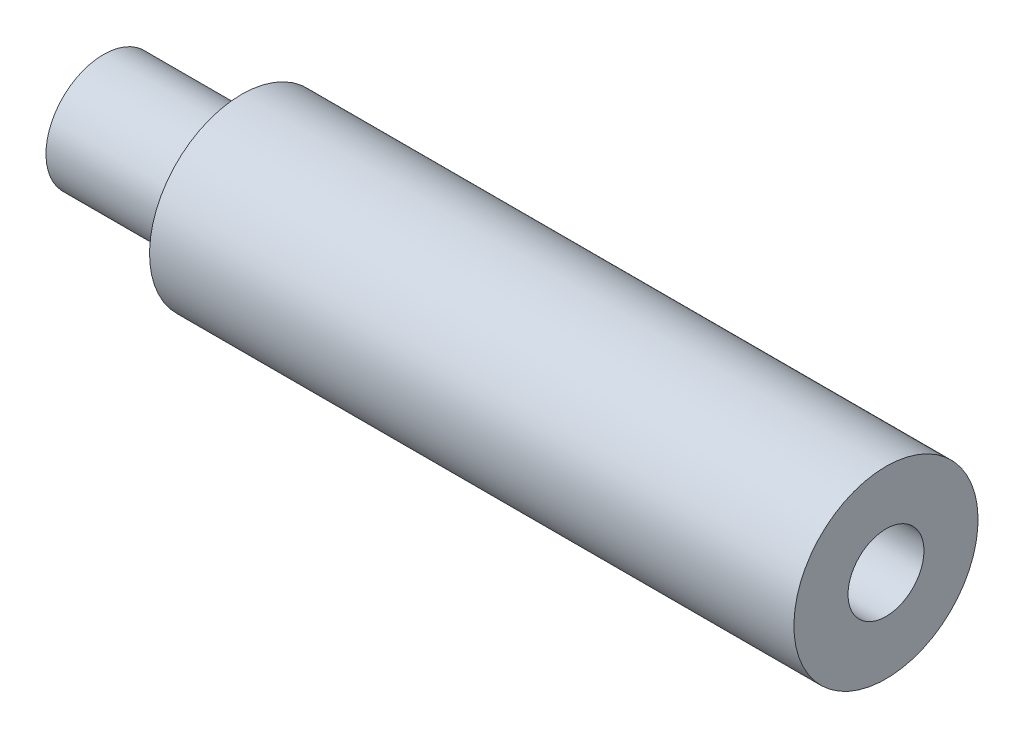
ISO-10303-21;
HEADER;
FILE_DESCRIPTION(('STEP AP214'),'2;1');
FILE_NAME('part.step','',(''),(''),'','','');
FILE_SCHEMA(('AUTOMOTIVE_DESIGN { 1 0 10303 214 1 1 1 1 }'));
ENDSEC;
DATA;
#1=APPLICATION_CONTEXT('core data for automotive mechanical design processes');
#2=APPLICATION_PROTOCOL_DEFINITION('international standard','automotive_design',2000,#1);
#3=PRODUCT_CONTEXT('',#1,'mechanical');
#4=PRODUCT('Part','Part','',(#3));
#5=PRODUCT_RELATED_PRODUCT_CATEGORY('part','',(#4));
#6=PRODUCT_DEFINITION_FORMATION('','',#4);
#7=PRODUCT_DEFINITION_CONTEXT('part definition',#1,'design');
#8=PRODUCT_DEFINITION('design','',#6,#7);
#9=PRODUCT_DEFINITION_SHAPE('','',#8);
#10=(LENGTH_UNIT() NAMED_UNIT(*) SI_UNIT(.MILLI.,.METRE.));
#11=(NAMED_UNIT(*) PLANE_ANGLE_UNIT() SI_UNIT($,.RADIAN.));
#12=(NAMED_UNIT(*) SI_UNIT($,.STERADIAN.) SOLID_ANGLE_UNIT());
#13=UNCERTAINTY_MEASURE_WITH_UNIT(LENGTH_MEASURE(1.E-05),#10,'distance_accuracy_value','');
#14=(GEOMETRIC_REPRESENTATION_CONTEXT(3) GLOBAL_UNCERTAINTY_ASSIGNED_CONTEXT((#13)) GLOBAL_UNIT_ASSIGNED_CONTEXT((#10,
#11,#12)) REPRESENTATION_CONTEXT('',''));
#15=CARTESIAN_POINT('',(0.,0.,0.));
#16=DIRECTION('',(0.,0.,1.));
#17=DIRECTION('',(1.,0.,0.));
#18=AXIS2_PLACEMENT_3D('',#15,#16,#17);
#19=CARTESIAN_POINT('',(0.,0.,0.));
#20=DIRECTION('',(-1.,0.,0.));
#21=DIRECTION('',(0.,-1.,0.));
#22=AXIS2_PLACEMENT_3D('',#19,#20,#21);
#23=PLANE('',#22);
#24=CARTESIAN_POINT('',(0.,0.,0.));
#25=DIRECTION('',(1.,0.,0.));
#26=DIRECTION('',(0.,1.,0.));
#27=AXIS2_PLACEMENT_3D('',#24,#25,#26);
#28=CIRCLE('',#27,2.5);
#29=CARTESIAN_POINT('',(0.,2.5,0.));
#30=VERTEX_POINT('',#29);
#31=EDGE_CURVE('E11',#30,#30,#28,.T.);
#32=ORIENTED_EDGE('',*,*,#31,.F.);
#33=EDGE_LOOP('',(#32));
#34=FACE_BOUND('',#33,.T.);
#35=ADVANCED_FACE('F39',(#34),#23,.T.);
#36=CARTESIAN_POINT('',(34.,0.,0.));
#37=DIRECTION('',(1.,0.,0.));
#38=DIRECTION('',(0.,1.,0.));
#39=AXIS2_PLACEMENT_3D('',#36,#37,#38);
#40=CYLINDRICAL_SURFACE('',#39,2.5);
#41=ORIENTED_EDGE('',*,*,#31,.T.);
#42=EDGE_LOOP('',(#41));
#43=FACE_BOUND('',#42,.T.);
#44=CARTESIAN_POINT('',(6.,0.,0.));
#45=DIRECTION('',(1.,0.,0.));
#46=DIRECTION('',(0.,1.,0.));
#47=AXIS2_PLACEMENT_3D('',#44,#45,#46);
#48=CIRCLE('',#47,2.5);
#49=CARTESIAN_POINT('',(6.,2.5,0.));
#50=VERTEX_POINT('',#49);
#51=EDGE_CURVE('E45',#50,#50,#48,.T.);
#52=ORIENTED_EDGE('',*,*,#51,.F.);
#53=EDGE_LOOP('',(#52));
#54=FACE_BOUND('',#53,.T.);
#55=ADVANCED_FACE('F74',(#43,#54),#40,.T.);
#56=CARTESIAN_POINT('',(6.,2.5,0.));
#57=DIRECTION('',(-1.,0.,0.));
#58=DIRECTION('',(0.,-1.,0.));
#59=AXIS2_PLACEMENT_3D('',#56,#57,#58);
#60=PLANE('',#59);
#61=ORIENTED_EDGE('',*,*,#51,.T.);
#62=EDGE_LOOP('',(#61));
#63=FACE_BOUND('',#62,.T.);
#64=CARTESIAN_POINT('',(6.,0.,0.));
#65=DIRECTION('',(1.,0.,0.));
#66=DIRECTION('',(0.,1.,0.));
#67=AXIS2_PLACEMENT_3D('',#64,#65,#66);
#68=CIRCLE('',#67,4.);
#69=CARTESIAN_POINT('',(6.,4.,0.));
#70=VERTEX_POINT('',#69);
#71=EDGE_CURVE('E66',#70,#70,#68,.T.);
#72=ORIENTED_EDGE('',*,*,#71,.F.);
#73=EDGE_LOOP('',(#72));
#74=FACE_BOUND('',#73,.T.);
#75=ADVANCED_FACE('F71',(#63,#74),#60,.T.);
#76=CARTESIAN_POINT('',(34.,0.,0.));
#77=DIRECTION('',(1.,0.,0.));
#78=DIRECTION('',(0.,1.,0.));
#79=AXIS2_PLACEMENT_3D('',#76,#77,#78);
#80=CYLINDRICAL_SURFACE('',#79,4.);
#81=ORIENTED_EDGE('',*,*,#71,.T.);
#82=EDGE_LOOP('',(#81));
#83=FACE_BOUND('',#82,.T.);
#84=CARTESIAN_POINT('',(34.,0.,0.));
#85=DIRECTION('',(1.,0.,0.));
#86=DIRECTION('',(0.,1.,0.));
#87=AXIS2_PLACEMENT_3D('',#84,#85,#86);
#88=CIRCLE('',#87,4.);
#89=CARTESIAN_POINT('',(34.,4.,0.));
#90=VERTEX_POINT('',#89);
#91=EDGE_CURVE('E60',#90,#90,#88,.T.);
#92=ORIENTED_EDGE('',*,*,#91,.F.);
#93=EDGE_LOOP('',(#92));
#94=FACE_BOUND('',#93,.T.);
#95=ADVANCED_FACE('F81',(#83,#94),#80,.T.);
#96=CARTESIAN_POINT('',(34.,4.,0.));
#97=DIRECTION('',(1.,0.,0.));
#98=DIRECTION('',(0.,1.,0.));
#99=AXIS2_PLACEMENT_3D('',#96,#97,#98);
#100=PLANE('',#99);
#101=CARTESIAN_POINT('',(34.,0.,0.));
#102=DIRECTION('',(1.,0.,0.));
#103=DIRECTION('',(0.,0.,-1.));
#104=AXIS2_PLACEMENT_3D('',#101,#102,#103);
#105=CIRCLE('',#104,1.64999999999999);
#106=CARTESIAN_POINT('',(34.,0.,-1.64999999999999));
#107=VERTEX_POINT('',#106);
#108=EDGE_CURVE('E57',#107,#107,#105,.T.);
#109=ORIENTED_EDGE('',*,*,#108,.F.);
#110=EDGE_LOOP('',(#109));
#111=FACE_BOUND('',#110,.T.);
#112=ORIENTED_EDGE('',*,*,#91,.T.);
#113=EDGE_LOOP('',(#112));
#114=FACE_BOUND('',#113,.T.);
#115=ADVANCED_FACE('F87',(#111,#114),#100,.T.);
#116=CARTESIAN_POINT('',(34.,0.,0.));
#117=DIRECTION('',(1.,0.,0.));
#118=DIRECTION('',(0.,0.,-1.));
#119=AXIS2_PLACEMENT_3D('',#116,#117,#118);
#120=CYLINDRICAL_SURFACE('',#119,1.64999999999999);
#121=CARTESIAN_POINT('',(9.,0.,0.));
#122=DIRECTION('',(1.,0.,0.));
#123=DIRECTION('',(0.,0.,-1.));
#124=AXIS2_PLACEMENT_3D('',#121,#122,#123);
#125=CIRCLE('',#124,1.65);
#126=CARTESIAN_POINT('',(9.,0.,-1.65));
#127=VERTEX_POINT('',#126);
#128=EDGE_CURVE('E55',#127,#127,#125,.T.);
#129=ORIENTED_EDGE('',*,*,#128,.F.);
#130=EDGE_LOOP('',(#129));
#131=FACE_BOUND('',#130,.T.);
#132=ORIENTED_EDGE('',*,*,#108,.T.);
#133=EDGE_LOOP('',(#132));
#134=FACE_BOUND('',#133,.T.);
#135=ADVANCED_FACE('F51',(#131,#134),#120,.F.);
#136=CARTESIAN_POINT('',(9.,0.,0.));
#137=DIRECTION('',(1.,0.,0.));
#138=DIRECTION('',(0.,0.,-1.));
#139=AXIS2_PLACEMENT_3D('',#136,#137,#138);
#140=CONICAL_SURFACE('',#139,1.65,1.02974425867665);
#141=CARTESIAN_POINT('',(8.00857997860453,0.,0.));
#142=VERTEX_POINT('',#141);
#143=VERTEX_LOOP('',#142);
#144=FACE_BOUND('',#143,.T.);
#145=ORIENTED_EDGE('',*,*,#128,.T.);
#146=EDGE_LOOP('',(#145));
#147=FACE_BOUND('',#146,.T.);
#148=ADVANCED_FACE('F48',(#144,#147),#140,.F.);
#149=CLOSED_SHELL('',(#35,#55,#75,#95,#115,#135,#148));
#150=MANIFOLD_SOLID_BREP('B2',#149);
#151=ADVANCED_BREP_SHAPE_REPRESENTATION('',(#18,#150),#14);
#152=SHAPE_DEFINITION_REPRESENTATION(#9,#151);
ENDSEC;
END-ISO-10303-21;
